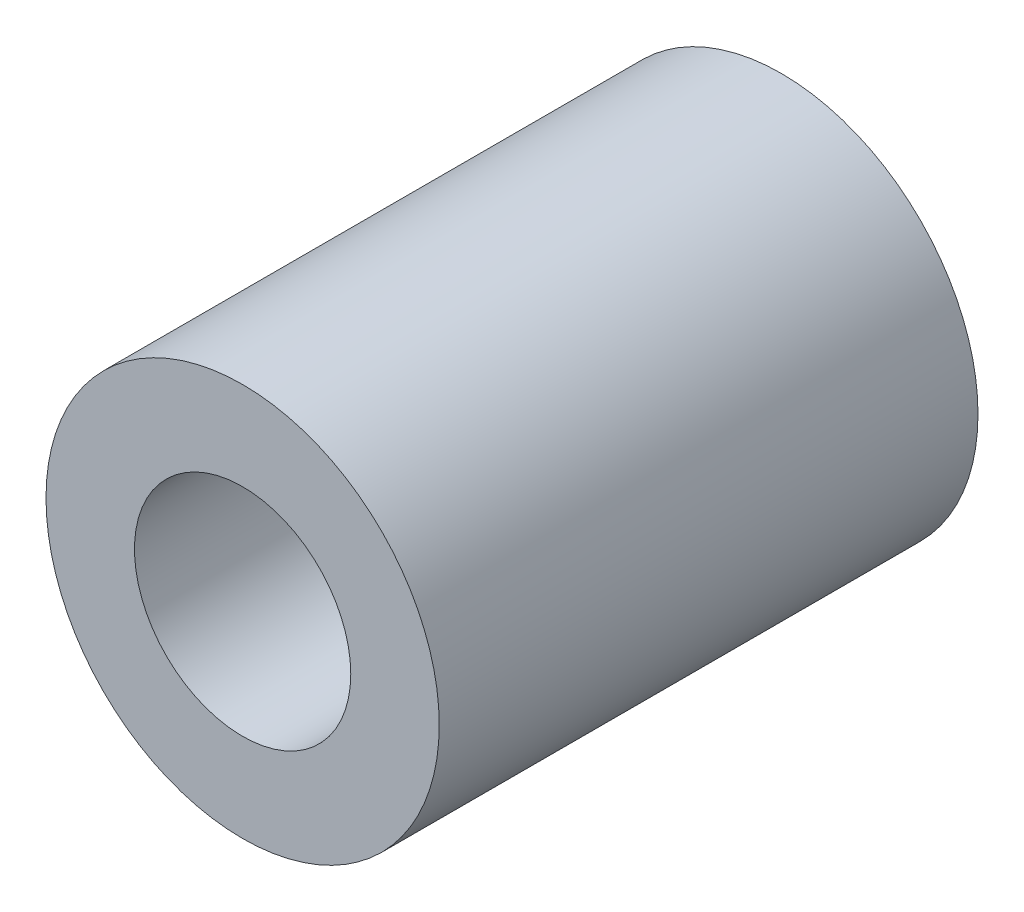
ISO-10303-21;
HEADER;
FILE_DESCRIPTION(('STEP AP214'),'2;1');
FILE_NAME('part.step','',(''),(''),'','','');
FILE_SCHEMA(('AUTOMOTIVE_DESIGN { 1 0 10303 214 1 1 1 1 }'));
ENDSEC;
DATA;
#1=APPLICATION_CONTEXT('core data for automotive mechanical design processes');
#2=APPLICATION_PROTOCOL_DEFINITION('international standard','automotive_design',2000,#1);
#3=PRODUCT_CONTEXT('',#1,'mechanical');
#4=PRODUCT('Part','Part','',(#3));
#5=PRODUCT_RELATED_PRODUCT_CATEGORY('part','',(#4));
#6=PRODUCT_DEFINITION_FORMATION('','',#4);
#7=PRODUCT_DEFINITION_CONTEXT('part definition',#1,'design');
#8=PRODUCT_DEFINITION('design','',#6,#7);
#9=PRODUCT_DEFINITION_SHAPE('','',#8);
#10=(LENGTH_UNIT() NAMED_UNIT(*) SI_UNIT(.MILLI.,.METRE.));
#11=(NAMED_UNIT(*) PLANE_ANGLE_UNIT() SI_UNIT($,.RADIAN.));
#12=(NAMED_UNIT(*) SI_UNIT($,.STERADIAN.) SOLID_ANGLE_UNIT());
#13=UNCERTAINTY_MEASURE_WITH_UNIT(LENGTH_MEASURE(1.E-05),#10,'distance_accuracy_value','');
#14=(GEOMETRIC_REPRESENTATION_CONTEXT(3) GLOBAL_UNCERTAINTY_ASSIGNED_CONTEXT((#13)) GLOBAL_UNIT_ASSIGNED_CONTEXT((#10,
#11,#12)) REPRESENTATION_CONTEXT('',''));
#15=CARTESIAN_POINT('',(0.,0.,0.));
#16=DIRECTION('',(0.,0.,1.));
#17=DIRECTION('',(1.,0.,0.));
#18=AXIS2_PLACEMENT_3D('',#15,#16,#17);
#19=CARTESIAN_POINT('',(0.,0.,13.7));
#20=DIRECTION('',(0.,0.,1.));
#21=DIRECTION('',(1.,0.,0.));
#22=AXIS2_PLACEMENT_3D('',#19,#20,#21);
#23=PLANE('',#22);
#24=CARTESIAN_POINT('',(0.,0.,13.7));
#25=DIRECTION('',(0.,0.,1.));
#26=DIRECTION('',(1.,0.,0.));
#27=AXIS2_PLACEMENT_3D('',#24,#25,#26);
#28=CIRCLE('',#27,5.);
#29=CARTESIAN_POINT('',(5.,0.,13.7));
#30=VERTEX_POINT('',#29);
#31=EDGE_CURVE('E10',#30,#30,#28,.T.);
#32=ORIENTED_EDGE('',*,*,#31,.T.);
#33=EDGE_LOOP('',(#32));
#34=FACE_BOUND('',#33,.T.);
#35=CARTESIAN_POINT('',(0.,0.,13.7));
#36=DIRECTION('',(0.,0.,1.));
#37=DIRECTION('',(1.,0.,0.));
#38=AXIS2_PLACEMENT_3D('',#35,#36,#37);
#39=CIRCLE('',#38,2.75);
#40=CARTESIAN_POINT('',(2.75,0.,13.7));
#41=VERTEX_POINT('',#40);
#42=EDGE_CURVE('E50',#41,#41,#39,.T.);
#43=ORIENTED_EDGE('',*,*,#42,.F.);
#44=EDGE_LOOP('',(#43));
#45=FACE_BOUND('',#44,.T.);
#46=ADVANCED_FACE('F37',(#34,#45),#23,.T.);
#47=CARTESIAN_POINT('',(0.,0.,0.));
#48=DIRECTION('',(0.,0.,1.));
#49=DIRECTION('',(1.,0.,0.));
#50=AXIS2_PLACEMENT_3D('',#47,#48,#49);
#51=PLANE('',#50);
#52=CARTESIAN_POINT('',(0.,0.,0.));
#53=DIRECTION('',(0.,0.,1.));
#54=DIRECTION('',(1.,0.,0.));
#55=AXIS2_PLACEMENT_3D('',#52,#53,#54);
#56=CIRCLE('',#55,5.);
#57=CARTESIAN_POINT('',(5.,0.,0.));
#58=VERTEX_POINT('',#57);
#59=EDGE_CURVE('E41',#58,#58,#56,.T.);
#60=ORIENTED_EDGE('',*,*,#59,.F.);
#61=EDGE_LOOP('',(#60));
#62=FACE_BOUND('',#61,.T.);
#63=CARTESIAN_POINT('',(0.,0.,0.));
#64=DIRECTION('',(0.,0.,1.));
#65=DIRECTION('',(1.,0.,0.));
#66=AXIS2_PLACEMENT_3D('',#63,#64,#65);
#67=CIRCLE('',#66,2.75);
#68=CARTESIAN_POINT('',(2.75,0.,0.));
#69=VERTEX_POINT('',#68);
#70=EDGE_CURVE('E52',#69,#69,#67,.T.);
#71=ORIENTED_EDGE('',*,*,#70,.T.);
#72=EDGE_LOOP('',(#71));
#73=FACE_BOUND('',#72,.T.);
#74=ADVANCED_FACE('F64',(#62,#73),#51,.F.);
#75=CARTESIAN_POINT('',(0.,0.,13.7));
#76=DIRECTION('',(0.,0.,-1.));
#77=DIRECTION('',(-1.,0.,0.));
#78=AXIS2_PLACEMENT_3D('',#75,#76,#77);
#79=CYLINDRICAL_SURFACE('',#78,5.);
#80=ORIENTED_EDGE('',*,*,#31,.F.);
#81=EDGE_LOOP('',(#80));
#82=FACE_BOUND('',#81,.T.);
#83=ORIENTED_EDGE('',*,*,#59,.T.);
#84=EDGE_LOOP('',(#83));
#85=FACE_BOUND('',#84,.T.);
#86=ADVANCED_FACE('F39',(#82,#85),#79,.T.);
#87=CARTESIAN_POINT('',(0.,0.,13.7));
#88=DIRECTION('',(0.,0.,-1.));
#89=DIRECTION('',(-1.,0.,0.));
#90=AXIS2_PLACEMENT_3D('',#87,#88,#89);
#91=CYLINDRICAL_SURFACE('',#90,2.75);
#92=ORIENTED_EDGE('',*,*,#42,.T.);
#93=EDGE_LOOP('',(#92));
#94=FACE_BOUND('',#93,.T.);
#95=ORIENTED_EDGE('',*,*,#70,.F.);
#96=EDGE_LOOP('',(#95));
#97=FACE_BOUND('',#96,.T.);
#98=ADVANCED_FACE('F60',(#94,#97),#91,.F.);
#99=CLOSED_SHELL('',(#46,#74,#86,#98));
#100=MANIFOLD_SOLID_BREP('B2',#99);
#101=ADVANCED_BREP_SHAPE_REPRESENTATION('',(#18,#100),#14);
#102=SHAPE_DEFINITION_REPRESENTATION(#9,#101);
ENDSEC;
END-ISO-10303-21;
